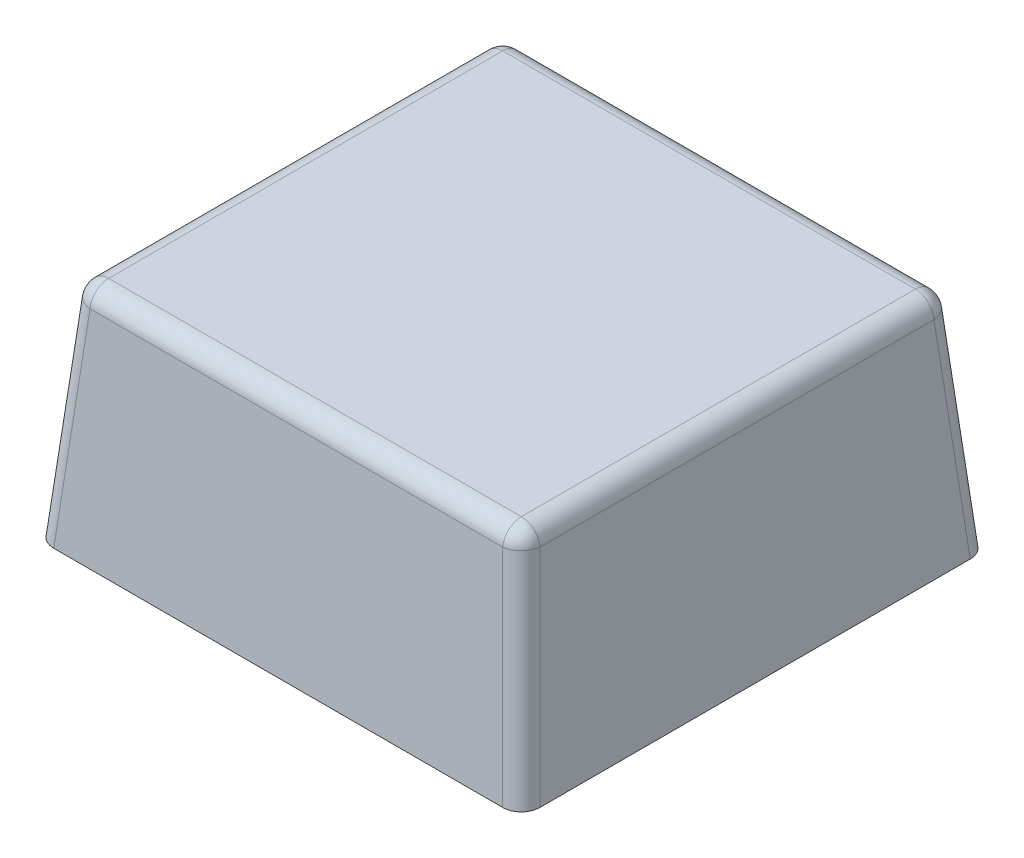
ISO-10303-21;
HEADER;
FILE_DESCRIPTION(('STEP AP214'),'2;1');
FILE_NAME('part.step','',(''),(''),'','','');
FILE_SCHEMA(('AUTOMOTIVE_DESIGN { 1 0 10303 214 1 1 1 1 }'));
ENDSEC;
DATA;
#1=APPLICATION_CONTEXT('core data for automotive mechanical design processes');
#2=APPLICATION_PROTOCOL_DEFINITION('international standard','automotive_design',2000,#1);
#3=PRODUCT_CONTEXT('',#1,'mechanical');
#4=PRODUCT('Part','Part','',(#3));
#5=PRODUCT_RELATED_PRODUCT_CATEGORY('part','',(#4));
#6=PRODUCT_DEFINITION_FORMATION('','',#4);
#7=PRODUCT_DEFINITION_CONTEXT('part definition',#1,'design');
#8=PRODUCT_DEFINITION('design','',#6,#7);
#9=PRODUCT_DEFINITION_SHAPE('','',#8);
#10=(LENGTH_UNIT() NAMED_UNIT(*) SI_UNIT(.MILLI.,.METRE.));
#11=(NAMED_UNIT(*) PLANE_ANGLE_UNIT() SI_UNIT($,.RADIAN.));
#12=(NAMED_UNIT(*) SI_UNIT($,.STERADIAN.) SOLID_ANGLE_UNIT());
#13=UNCERTAINTY_MEASURE_WITH_UNIT(LENGTH_MEASURE(1.E-05),#10,'distance_accuracy_value','');
#14=(GEOMETRIC_REPRESENTATION_CONTEXT(3) GLOBAL_UNCERTAINTY_ASSIGNED_CONTEXT((#13)) GLOBAL_UNIT_ASSIGNED_CONTEXT((#10,
#11,#12)) REPRESENTATION_CONTEXT('',''));
#15=CARTESIAN_POINT('',(0.,0.,0.));
#16=DIRECTION('',(0.,0.,1.));
#17=DIRECTION('',(1.,0.,0.));
#18=AXIS2_PLACEMENT_3D('',#15,#16,#17);
#19=CARTESIAN_POINT('',(0.,0.85,-0.526690243184));
#20=DIRECTION('',(-1.,0.,0.));
#21=DIRECTION('',(0.,0.,1.));
#22=AXIS2_PLACEMENT_3D('',#19,#20,#21);
#23=CYLINDRICAL_SURFACE('',#22,0.05);
#24=CARTESIAN_POINT('',(0.551690243184,0.85,-0.526690243184));
#25=DIRECTION('',(-1.,0.,0.));
#26=DIRECTION('',(0.,0.,-1.));
#27=AXIS2_PLACEMENT_3D('',#24,#25,#26);
#28=CIRCLE('',#27,0.05);
#29=CARTESIAN_POINT('',(0.551690243184,0.9,-0.526690243184));
#30=VERTEX_POINT('',#29);
#31=CARTESIAN_POINT('',(0.551690243184,0.854357787137,-0.576499978088));
#32=VERTEX_POINT('',#31);
#33=EDGE_CURVE('E20',#30,#32,#28,.T.);
#34=ORIENTED_EDGE('',*,*,#33,.T.);
#35=DIRECTION('',(1.,0.,0.));
#36=VECTOR('',#35,1.);
#37=CARTESIAN_POINT('',(0.597506801884,0.854357787137,-0.576499978088));
#38=LINE('',#37,#36);
#39=CARTESIAN_POINT('',(-0.551690243184,0.854357787137,-0.576499978088));
#40=VERTEX_POINT('',#39);
#41=EDGE_CURVE('E133',#40,#32,#38,.T.);
#42=ORIENTED_EDGE('',*,*,#41,.F.);
#43=CARTESIAN_POINT('',(-0.551690243184,0.85,-0.526690243184));
#44=DIRECTION('',(1.,0.,0.));
#45=DIRECTION('',(0.,0.,1.));
#46=AXIS2_PLACEMENT_3D('',#43,#44,#45);
#47=CIRCLE('',#46,0.05);
#48=CARTESIAN_POINT('',(-0.551690243184,0.9,-0.526690243184));
#49=VERTEX_POINT('',#48);
#50=EDGE_CURVE('E11',#40,#49,#47,.T.);
#51=ORIENTED_EDGE('',*,*,#50,.T.);
#52=DIRECTION('',(-1.,0.,0.));
#53=VECTOR('',#52,1.);
#54=CARTESIAN_POINT('',(-0.597506801884,0.9,-0.526690243184));
#55=LINE('',#54,#53);
#56=EDGE_CURVE('E114',#30,#49,#55,.T.);
#57=ORIENTED_EDGE('',*,*,#56,.F.);
#58=EDGE_LOOP('',(#34,#42,#51,#57));
#59=FACE_BOUND('',#58,.T.);
#60=ADVANCED_FACE('F17',(#59),#23,.T.);
#61=CARTESIAN_POINT('',(-0.551690243184,0.85,-0.526690243184));
#62=DIRECTION('',(0.,1.,0.));
#63=DIRECTION('',(1.,0.,0.));
#64=AXIS2_PLACEMENT_3D('',#61,#62,#63);
#65=SPHERICAL_SURFACE('',#64,0.05);
#66=CARTESIAN_POINT('',(-0.551690243184,0.85,-0.526690243184));
#67=DIRECTION('',(0.0868265938642471,0.992432509138969,0.0868265938642274));
#68=DIRECTION('',(0.,-0.0871557427476379,0.996194698091747));
#69=AXIS2_PLACEMENT_3D('',#66,#67,#68);
#70=CIRCLE('',#69,0.05);
#71=CARTESIAN_POINT('',(-0.601499978088,0.854357787137,-0.526690243184));
#72=VERTEX_POINT('',#71);
#73=EDGE_CURVE('E100',#40,#72,#70,.T.);
#74=ORIENTED_EDGE('',*,*,#73,.T.);
#75=CARTESIAN_POINT('',(-0.551690243184,0.85,-0.526690243184));
#76=DIRECTION('',(0.,0.,-1.));
#77=DIRECTION('',(0.,1.,0.));
#78=AXIS2_PLACEMENT_3D('',#75,#76,#77);
#79=CIRCLE('',#78,0.05);
#80=EDGE_CURVE('E111',#72,#49,#79,.T.);
#81=ORIENTED_EDGE('',*,*,#80,.T.);
#82=ORIENTED_EDGE('',*,*,#50,.F.);
#83=EDGE_LOOP('',(#74,#81,#82));
#84=FACE_BOUND('',#83,.T.);
#85=ADVANCED_FACE('F329',(#84),#65,.T.);
#86=CARTESIAN_POINT('',(0.551690243184,0.85,-0.526690243184));
#87=DIRECTION('',(0.,1.,0.));
#88=DIRECTION('',(1.,0.,0.));
#89=AXIS2_PLACEMENT_3D('',#86,#87,#88);
#90=SPHERICAL_SURFACE('',#89,0.05);
#91=CARTESIAN_POINT('',(0.551690243184,0.85,-0.526690243184));
#92=DIRECTION('',(0.,0.,-1.));
#93=DIRECTION('',(-1.,0.,0.));
#94=AXIS2_PLACEMENT_3D('',#91,#92,#93);
#95=CIRCLE('',#94,0.05);
#96=CARTESIAN_POINT('',(0.601499978088,0.854357787137,-0.526690243184));
#97=VERTEX_POINT('',#96);
#98=EDGE_CURVE('E92',#30,#97,#95,.T.);
#99=ORIENTED_EDGE('',*,*,#98,.T.);
#100=CARTESIAN_POINT('',(0.551690243184,0.85,-0.526690243184));
#101=DIRECTION('',(-0.0868265938642471,0.992432509138969,0.0868265938642274));
#102=DIRECTION('',(0.,-0.0871557427476379,0.996194698091747));
#103=AXIS2_PLACEMENT_3D('',#100,#101,#102);
#104=CIRCLE('',#103,0.05);
#105=EDGE_CURVE('E94',#97,#32,#104,.T.);
#106=ORIENTED_EDGE('',*,*,#105,.T.);
#107=ORIENTED_EDGE('',*,*,#33,.F.);
#108=EDGE_LOOP('',(#99,#106,#107));
#109=FACE_BOUND('',#108,.T.);
#110=ADVANCED_FACE('F91',(#109),#90,.T.);
#111=CARTESIAN_POINT('',(-0.591142201832,0.399062049208,-0.566142201832));
#112=DIRECTION('',(-0.0868265938642274,-0.992432509138969,-0.0868265938642471));
#113=DIRECTION('',(0.996194698091747,-0.0871557427476379,0.));
#114=AXIS2_PLACEMENT_3D('',#111,#112,#113);
#115=CYLINDRICAL_SURFACE('',#114,0.05);
#116=CARTESIAN_POINT('',(-0.65,0.3,-0.575190265095));
#117=CARTESIAN_POINT('',(-0.65,0.3,-0.604413846781));
#118=CARTESIAN_POINT('',(-0.629413846781,0.3,-0.625));
#119=CARTESIAN_POINT('',(-0.600190265095,0.3,-0.625));
#120=(BOUNDED_CURVE() B_SPLINE_CURVE(3,(#116,#117,#118,#119),.UNSPECIFIED.,.F.,
.F.) B_SPLINE_CURVE_WITH_KNOTS((4,4),(5.501585242055,7.064785372304),
.UNSPECIFIED.) CURVE() GEOMETRIC_REPRESENTATION_ITEM() RATIONAL_B_SPLINE_CURVE((1.,
0.806524890385,0.806524890385,1.)) REPRESENTATION_ITEM(''));
#121=CARTESIAN_POINT('',(-0.65,0.3,-0.575190265095));
#122=VERTEX_POINT('',#121);
#123=CARTESIAN_POINT('',(-0.600190265095,0.3,-0.625));
#124=VERTEX_POINT('',#123);
#125=EDGE_CURVE('E141',#122,#124,#120,.T.);
#126=ORIENTED_EDGE('',*,*,#125,.F.);
#127=DIRECTION('',(-0.0868265938642471,-0.992432509138967,-0.0868265938642471));
#128=VECTOR('',#127,1.);
#129=CARTESIAN_POINT('',(-0.640951936736,0.403419836345,-0.566142201832));
#130=LINE('',#129,#128);
#131=EDGE_CURVE('E234',#72,#122,#130,.T.);
#132=ORIENTED_EDGE('',*,*,#131,.F.);
#133=ORIENTED_EDGE('',*,*,#73,.F.);
#134=DIRECTION('',(0.0868265938642471,0.992432509138967,0.0868265938642471));
#135=VECTOR('',#134,1.);
#136=CARTESIAN_POINT('',(-0.590765258961,0.407728313066,-0.615574993866));
#137=LINE('',#136,#135);
#138=EDGE_CURVE('E199',#124,#40,#137,.T.);
#139=ORIENTED_EDGE('',*,*,#138,.F.);
#140=EDGE_LOOP('',(#126,#132,#133,#139));
#141=FACE_BOUND('',#140,.T.);
#142=ADVANCED_FACE('F229',(#141),#115,.T.);
#143=CARTESIAN_POINT('',(-0.551690243184,0.85,0.));
#144=DIRECTION('',(0.,0.,1.));
#145=DIRECTION('',(1.,0.,0.));
#146=AXIS2_PLACEMENT_3D('',#143,#144,#145);
#147=CYLINDRICAL_SURFACE('',#146,0.05);
#148=CARTESIAN_POINT('',(-0.551690243184,0.85,0.526690243184));
#149=DIRECTION('',(0.,0.,-1.));
#150=DIRECTION('',(1.,0.,0.));
#151=AXIS2_PLACEMENT_3D('',#148,#149,#150);
#152=CIRCLE('',#151,0.05);
#153=CARTESIAN_POINT('',(-0.601499978088,0.854357787137,0.526690243184));
#154=VERTEX_POINT('',#153);
#155=CARTESIAN_POINT('',(-0.551690243184,0.9,0.526690243184));
#156=VERTEX_POINT('',#155);
#157=EDGE_CURVE('E39',#154,#156,#152,.T.);
#158=ORIENTED_EDGE('',*,*,#157,.T.);
#159=DIRECTION('',(0.,0.,1.));
#160=VECTOR('',#159,1.);
#161=CARTESIAN_POINT('',(-0.551690243184,0.9,0.572506801884));
#162=LINE('',#161,#160);
#163=EDGE_CURVE('E119',#49,#156,#162,.T.);
#164=ORIENTED_EDGE('',*,*,#163,.F.);
#165=ORIENTED_EDGE('',*,*,#80,.F.);
#166=DIRECTION('',(0.,0.,-1.));
#167=VECTOR('',#166,1.);
#168=CARTESIAN_POINT('',(-0.601499978088,0.854357787137,-0.572506801884));
#169=LINE('',#168,#167);
#170=EDGE_CURVE('E243',#154,#72,#169,.T.);
#171=ORIENTED_EDGE('',*,*,#170,.F.);
#172=EDGE_LOOP('',(#158,#164,#165,#171));
#173=FACE_BOUND('',#172,.T.);
#174=ADVANCED_FACE('F349',(#173),#147,.T.);
#175=CARTESIAN_POINT('',(0.551690243184,0.85,0.));
#176=DIRECTION('',(0.,0.,-1.));
#177=DIRECTION('',(-1.,0.,0.));
#178=AXIS2_PLACEMENT_3D('',#175,#176,#177);
#179=CYLINDRICAL_SURFACE('',#178,0.05);
#180=CARTESIAN_POINT('',(0.551690243184,0.85,0.526690243184));
#181=DIRECTION('',(0.,0.,-1.));
#182=DIRECTION('',(0.,-1.,0.));
#183=AXIS2_PLACEMENT_3D('',#180,#181,#182);
#184=CIRCLE('',#183,0.05);
#185=CARTESIAN_POINT('',(0.551690243184,0.9,0.526690243184));
#186=VERTEX_POINT('',#185);
#187=CARTESIAN_POINT('',(0.601499978088,0.854357787137,0.526690243184));
#188=VERTEX_POINT('',#187);
#189=EDGE_CURVE('E144',#186,#188,#184,.T.);
#190=ORIENTED_EDGE('',*,*,#189,.T.);
#191=DIRECTION('',(0.,0.,1.));
#192=VECTOR('',#191,1.);
#193=CARTESIAN_POINT('',(0.601499978088,0.854357787137,0.572506801884));
#194=LINE('',#193,#192);
#195=EDGE_CURVE('E108',#97,#188,#194,.T.);
#196=ORIENTED_EDGE('',*,*,#195,.F.);
#197=ORIENTED_EDGE('',*,*,#98,.F.);
#198=DIRECTION('',(0.,0.,-1.));
#199=VECTOR('',#198,1.);
#200=CARTESIAN_POINT('',(0.551690243184,0.9,-0.572506801884));
#201=LINE('',#200,#199);
#202=EDGE_CURVE('E106',#186,#30,#201,.T.);
#203=ORIENTED_EDGE('',*,*,#202,.F.);
#204=EDGE_LOOP('',(#190,#196,#197,#203));
#205=FACE_BOUND('',#204,.T.);
#206=ADVANCED_FACE('F104',(#205),#179,.T.);
#207=CARTESIAN_POINT('',(0.600565773584,0.291350131197,-0.575565773584));
#208=DIRECTION('',(0.0868265938642471,-0.992432509138969,-0.0868265938642274));
#209=DIRECTION('',(0.,0.0871557427476379,-0.996194698091747));
#210=AXIS2_PLACEMENT_3D('',#207,#208,#209);
#211=CYLINDRICAL_SURFACE('',#210,0.05);
#212=CARTESIAN_POINT('',(0.600190265095,0.3,-0.625));
#213=CARTESIAN_POINT('',(0.629413846781,0.3,-0.625));
#214=CARTESIAN_POINT('',(0.65,0.3,-0.604413846781));
#215=CARTESIAN_POINT('',(0.65,0.3,-0.575190265095));
#216=(BOUNDED_CURVE() B_SPLINE_CURVE(3,(#212,#213,#214,#215),.UNSPECIFIED.,.F.,
.F.) B_SPLINE_CURVE_WITH_KNOTS((4,4),(5.501585242055,7.064785372304),
.UNSPECIFIED.) CURVE() GEOMETRIC_REPRESENTATION_ITEM() RATIONAL_B_SPLINE_CURVE((1.,
0.806524890385,0.806524890385,1.)) REPRESENTATION_ITEM(''));
#217=CARTESIAN_POINT('',(0.600190265095,0.3,-0.625));
#218=VERTEX_POINT('',#217);
#219=CARTESIAN_POINT('',(0.65,0.3,-0.575190265095));
#220=VERTEX_POINT('',#219);
#221=EDGE_CURVE('E149',#218,#220,#216,.T.);
#222=ORIENTED_EDGE('',*,*,#221,.F.);
#223=DIRECTION('',(0.0868265938642471,-0.992432509138967,-0.0868265938642471));
#224=VECTOR('',#223,1.);
#225=CARTESIAN_POINT('',(0.600565773584,0.295707918334,-0.625375508489));
#226=LINE('',#225,#224);
#227=EDGE_CURVE('E126',#32,#218,#226,.T.);
#228=ORIENTED_EDGE('',*,*,#227,.F.);
#229=ORIENTED_EDGE('',*,*,#105,.F.);
#230=DIRECTION('',(-0.0868265938642471,0.992432509138967,0.0868265938642471));
#231=VECTOR('',#230,1.);
#232=CARTESIAN_POINT('',(0.640951936736,0.403419836345,-0.566142201832));
#233=LINE('',#232,#231);
#234=EDGE_CURVE('E204',#220,#97,#233,.T.);
#235=ORIENTED_EDGE('',*,*,#234,.F.);
#236=EDGE_LOOP('',(#222,#228,#229,#235));
#237=FACE_BOUND('',#236,.T.);
#238=ADVANCED_FACE('F360',(#237),#211,.T.);
#239=CARTESIAN_POINT('',(-0.551690243184,0.85,0.526690243184));
#240=DIRECTION('',(0.,1.,0.));
#241=DIRECTION('',(1.,0.,0.));
#242=AXIS2_PLACEMENT_3D('',#239,#240,#241);
#243=SPHERICAL_SURFACE('',#242,0.05);
#244=CARTESIAN_POINT('',(-0.551690243184,0.85,0.526690243184));
#245=DIRECTION('',(0.0868265938642471,0.992432509138969,-0.0868265938642274));
#246=DIRECTION('',(0.,0.0871557427476379,0.996194698091747));
#247=AXIS2_PLACEMENT_3D('',#244,#245,#246);
#248=CIRCLE('',#247,0.05);
#249=CARTESIAN_POINT('',(-0.551690243184,0.854357787137,0.576499978088));
#250=VERTEX_POINT('',#249);
#251=EDGE_CURVE('E178',#154,#250,#248,.T.);
#252=ORIENTED_EDGE('',*,*,#251,.T.);
#253=CARTESIAN_POINT('',(-0.551690243184,0.85,0.526690243184));
#254=DIRECTION('',(-1.,0.,0.));
#255=DIRECTION('',(0.,0.,1.));
#256=AXIS2_PLACEMENT_3D('',#253,#254,#255);
#257=CIRCLE('',#256,0.05);
#258=EDGE_CURVE('E174',#250,#156,#257,.T.);
#259=ORIENTED_EDGE('',*,*,#258,.T.);
#260=ORIENTED_EDGE('',*,*,#157,.F.);
#261=EDGE_LOOP('',(#252,#259,#260));
#262=FACE_BOUND('',#261,.T.);
#263=ADVANCED_FACE('F354',(#262),#243,.T.);
#264=CARTESIAN_POINT('',(0.551690243184,0.85,0.526690243184));
#265=DIRECTION('',(0.,1.,0.));
#266=DIRECTION('',(1.,0.,0.));
#267=AXIS2_PLACEMENT_3D('',#264,#265,#266);
#268=SPHERICAL_SURFACE('',#267,0.05);
#269=CARTESIAN_POINT('',(0.551690243184,0.85,0.526690243184));
#270=DIRECTION('',(1.,0.,0.));
#271=DIRECTION('',(0.,0.,-1.));
#272=AXIS2_PLACEMENT_3D('',#269,#270,#271);
#273=CIRCLE('',#272,0.05);
#274=CARTESIAN_POINT('',(0.551690243184,0.854357787137,0.576499978088));
#275=VERTEX_POINT('',#274);
#276=EDGE_CURVE('E177',#186,#275,#273,.T.);
#277=ORIENTED_EDGE('',*,*,#276,.T.);
#278=CARTESIAN_POINT('',(0.551690243184,0.85,0.526690243184));
#279=DIRECTION('',(-0.0868265938642471,0.992432509138969,-0.0868265938642274));
#280=DIRECTION('',(0.,0.0871557427476379,0.996194698091747));
#281=AXIS2_PLACEMENT_3D('',#278,#279,#280);
#282=CIRCLE('',#281,0.05);
#283=EDGE_CURVE('E167',#275,#188,#282,.T.);
#284=ORIENTED_EDGE('',*,*,#283,.T.);
#285=ORIENTED_EDGE('',*,*,#189,.F.);
#286=EDGE_LOOP('',(#277,#284,#285));
#287=FACE_BOUND('',#286,.T.);
#288=ADVANCED_FACE('F359',(#287),#268,.T.);
#289=CARTESIAN_POINT('',(-0.590765258961,0.403370525928,0.565765258961));
#290=DIRECTION('',(-0.0868265938642471,-0.992432509138969,0.0868265938642274));
#291=DIRECTION('',(0.,-0.0871557427476379,-0.996194698091747));
#292=AXIS2_PLACEMENT_3D('',#289,#290,#291);
#293=CYLINDRICAL_SURFACE('',#292,0.05);
#294=CARTESIAN_POINT('',(-0.600190265095,0.3,0.625));
#295=CARTESIAN_POINT('',(-0.629413846781,0.3,0.625));
#296=CARTESIAN_POINT('',(-0.65,0.3,0.604413846781));
#297=CARTESIAN_POINT('',(-0.65,0.3,0.575190265095));
#298=(BOUNDED_CURVE() B_SPLINE_CURVE(3,(#294,#295,#296,#297),.UNSPECIFIED.,.F.,
.F.) B_SPLINE_CURVE_WITH_KNOTS((4,4),(5.501585242055,7.064785372304),
.UNSPECIFIED.) CURVE() GEOMETRIC_REPRESENTATION_ITEM() RATIONAL_B_SPLINE_CURVE((1.,
0.806524890385,0.806524890385,1.)) REPRESENTATION_ITEM(''));
#299=CARTESIAN_POINT('',(-0.600190265095,0.3,0.625));
#300=VERTEX_POINT('',#299);
#301=CARTESIAN_POINT('',(-0.65,0.3,0.575190265095));
#302=VERTEX_POINT('',#301);
#303=EDGE_CURVE('E158',#300,#302,#298,.T.);
#304=ORIENTED_EDGE('',*,*,#303,.F.);
#305=DIRECTION('',(-0.0868265938642471,-0.992432509138967,0.0868265938642471));
#306=VECTOR('',#305,1.);
#307=CARTESIAN_POINT('',(-0.590765258961,0.407728313066,0.615574993866));
#308=LINE('',#307,#306);
#309=EDGE_CURVE('E275',#250,#300,#308,.T.);
#310=ORIENTED_EDGE('',*,*,#309,.F.);
#311=ORIENTED_EDGE('',*,*,#251,.F.);
#312=DIRECTION('',(0.0868265938642471,0.992432509138967,-0.0868265938642471));
#313=VECTOR('',#312,1.);
#314=CARTESIAN_POINT('',(-0.650375508489,0.295707918334,0.575565773584));
#315=LINE('',#314,#313);
#316=EDGE_CURVE('E248',#302,#154,#315,.T.);
#317=ORIENTED_EDGE('',*,*,#316,.F.);
#318=EDGE_LOOP('',(#304,#310,#311,#317));
#319=FACE_BOUND('',#318,.T.);
#320=ADVANCED_FACE('F309',(#319),#293,.T.);
#321=CARTESIAN_POINT('',(0.,0.85,0.526690243184));
#322=DIRECTION('',(1.,0.,0.));
#323=DIRECTION('',(0.,0.,-1.));
#324=AXIS2_PLACEMENT_3D('',#321,#322,#323);
#325=CYLINDRICAL_SURFACE('',#324,0.05);
#326=ORIENTED_EDGE('',*,*,#258,.F.);
#327=DIRECTION('',(-1.,0.,0.));
#328=VECTOR('',#327,1.);
#329=CARTESIAN_POINT('',(-0.597506801884,0.854357787137,0.576499978088));
#330=LINE('',#329,#328);
#331=EDGE_CURVE('E267',#275,#250,#330,.T.);
#332=ORIENTED_EDGE('',*,*,#331,.F.);
#333=ORIENTED_EDGE('',*,*,#276,.F.);
#334=DIRECTION('',(1.,0.,0.));
#335=VECTOR('',#334,1.);
#336=CARTESIAN_POINT('',(0.597506801884,0.9,0.526690243184));
#337=LINE('',#336,#335);
#338=EDGE_CURVE('E124',#156,#186,#337,.T.);
#339=ORIENTED_EDGE('',*,*,#338,.F.);
#340=EDGE_LOOP('',(#326,#332,#333,#339));
#341=FACE_BOUND('',#340,.T.);
#342=ADVANCED_FACE('F301',(#341),#325,.T.);
#343=CARTESIAN_POINT('',(0.600565773584,0.291350131197,0.575565773584));
#344=DIRECTION('',(0.0868265938642274,-0.992432509138969,0.0868265938642471));
#345=DIRECTION('',(0.996194698091747,0.0871557427476379,0.));
#346=AXIS2_PLACEMENT_3D('',#343,#344,#345);
#347=CYLINDRICAL_SURFACE('',#346,0.05);
#348=CARTESIAN_POINT('',(0.65,0.3,0.575190265095));
#349=CARTESIAN_POINT('',(0.65,0.3,0.604413846781));
#350=CARTESIAN_POINT('',(0.629413846781,0.3,0.625));
#351=CARTESIAN_POINT('',(0.600190265095,0.3,0.625));
#352=(BOUNDED_CURVE() B_SPLINE_CURVE(3,(#348,#349,#350,#351),.UNSPECIFIED.,.F.,
.F.) B_SPLINE_CURVE_WITH_KNOTS((4,4),(5.501585242055,7.064785372304),
.UNSPECIFIED.) CURVE() GEOMETRIC_REPRESENTATION_ITEM() RATIONAL_B_SPLINE_CURVE((1.,
0.806524890385,0.806524890385,1.)) REPRESENTATION_ITEM(''));
#353=CARTESIAN_POINT('',(0.65,0.3,0.575190265095));
#354=VERTEX_POINT('',#353);
#355=CARTESIAN_POINT('',(0.600190265095,0.3,0.625));
#356=VERTEX_POINT('',#355);
#357=EDGE_CURVE('E157',#354,#356,#352,.T.);
#358=ORIENTED_EDGE('',*,*,#357,.F.);
#359=DIRECTION('',(0.0868265938642471,-0.992432509138967,0.0868265938642471));
#360=VECTOR('',#359,1.);
#361=CARTESIAN_POINT('',(0.650375508489,0.295707918334,0.575565773584));
#362=LINE('',#361,#360);
#363=EDGE_CURVE('E208',#188,#354,#362,.T.);
#364=ORIENTED_EDGE('',*,*,#363,.F.);
#365=ORIENTED_EDGE('',*,*,#283,.F.);
#366=DIRECTION('',(-0.0868265938642471,0.992432509138967,-0.0868265938642471));
#367=VECTOR('',#366,1.);
#368=CARTESIAN_POINT('',(0.600565773584,0.295707918334,0.625375508489));
#369=LINE('',#368,#367);
#370=EDGE_CURVE('E271',#356,#275,#369,.T.);
#371=ORIENTED_EDGE('',*,*,#370,.F.);
#372=EDGE_LOOP('',(#358,#364,#365,#371));
#373=FACE_BOUND('',#372,.T.);
#374=ADVANCED_FACE('F378',(#373),#347,.T.);
#375=CARTESIAN_POINT('',(0.,0.3,0.));
#376=DIRECTION('',(0.,1.,0.));
#377=DIRECTION('',(1.,0.,0.));
#378=AXIS2_PLACEMENT_3D('',#375,#376,#377);
#379=PLANE('',#378);
#380=DIRECTION('',(0.,0.,1.));
#381=VECTOR('',#380,1.);
#382=CARTESIAN_POINT('',(-0.65,0.3,0.625));
#383=LINE('',#382,#381);
#384=EDGE_CURVE('E242',#122,#302,#383,.T.);
#385=ORIENTED_EDGE('',*,*,#384,.F.);
#386=ORIENTED_EDGE('',*,*,#125,.T.);
#387=DIRECTION('',(-1.,0.,0.));
#388=VECTOR('',#387,1.);
#389=CARTESIAN_POINT('',(0.65,0.3,-0.625));
#390=LINE('',#389,#388);
#391=EDGE_CURVE('E212',#218,#124,#390,.T.);
#392=ORIENTED_EDGE('',*,*,#391,.F.);
#393=ORIENTED_EDGE('',*,*,#221,.T.);
#394=DIRECTION('',(0.,0.,-1.));
#395=VECTOR('',#394,1.);
#396=CARTESIAN_POINT('',(0.65,0.3,0.625));
#397=LINE('',#396,#395);
#398=EDGE_CURVE('E207',#354,#220,#397,.T.);
#399=ORIENTED_EDGE('',*,*,#398,.F.);
#400=ORIENTED_EDGE('',*,*,#357,.T.);
#401=DIRECTION('',(1.,0.,0.));
#402=VECTOR('',#401,1.);
#403=CARTESIAN_POINT('',(0.65,0.3,0.625));
#404=LINE('',#403,#402);
#405=EDGE_CURVE('E279',#300,#356,#404,.T.);
#406=ORIENTED_EDGE('',*,*,#405,.F.);
#407=ORIENTED_EDGE('',*,*,#303,.T.);
#408=EDGE_LOOP('',(#385,#386,#392,#393,#399,#400,#406,#407));
#409=FACE_BOUND('',#408,.T.);
#410=ADVANCED_FACE('F394',(#409),#379,.F.);
#411=CARTESIAN_POINT('',(0.,0.9,0.));
#412=DIRECTION('',(0.,1.,0.));
#413=DIRECTION('',(1.,0.,0.));
#414=AXIS2_PLACEMENT_3D('',#411,#412,#413);
#415=PLANE('',#414);
#416=ORIENTED_EDGE('',*,*,#202,.T.);
#417=ORIENTED_EDGE('',*,*,#56,.T.);
#418=ORIENTED_EDGE('',*,*,#163,.T.);
#419=ORIENTED_EDGE('',*,*,#338,.T.);
#420=EDGE_LOOP('',(#416,#417,#418,#419));
#421=FACE_BOUND('',#420,.T.);
#422=ADVANCED_FACE('F122',(#421),#415,.T.);
#423=CARTESIAN_POINT('',(0.65,0.3,-0.625));
#424=DIRECTION('',(0.,0.0871557427476379,-0.996194698091747));
#425=DIRECTION('',(-1.,0.,0.));
#426=AXIS2_PLACEMENT_3D('',#423,#424,#425);
#427=PLANE('',#426);
#428=ORIENTED_EDGE('',*,*,#391,.T.);
#429=ORIENTED_EDGE('',*,*,#138,.T.);
#430=ORIENTED_EDGE('',*,*,#41,.T.);
#431=ORIENTED_EDGE('',*,*,#227,.T.);
#432=EDGE_LOOP('',(#428,#429,#430,#431));
#433=FACE_BOUND('',#432,.T.);
#434=ADVANCED_FACE('F225',(#433),#427,.T.);
#435=CARTESIAN_POINT('',(0.65,0.3,0.625));
#436=DIRECTION('',(0.996194698091747,0.0871557427476379,0.));
#437=DIRECTION('',(0.,0.,-1.));
#438=AXIS2_PLACEMENT_3D('',#435,#436,#437);
#439=PLANE('',#438);
#440=ORIENTED_EDGE('',*,*,#398,.T.);
#441=ORIENTED_EDGE('',*,*,#234,.T.);
#442=ORIENTED_EDGE('',*,*,#195,.T.);
#443=ORIENTED_EDGE('',*,*,#363,.T.);
#444=EDGE_LOOP('',(#440,#441,#442,#443));
#445=FACE_BOUND('',#444,.T.);
#446=ADVANCED_FACE('F423',(#445),#439,.T.);
#447=CARTESIAN_POINT('',(0.65,0.3,0.625));
#448=DIRECTION('',(0.,0.0871557427476379,0.996194698091747));
#449=DIRECTION('',(1.,0.,0.));
#450=AXIS2_PLACEMENT_3D('',#447,#448,#449);
#451=PLANE('',#450);
#452=ORIENTED_EDGE('',*,*,#331,.T.);
#453=ORIENTED_EDGE('',*,*,#309,.T.);
#454=ORIENTED_EDGE('',*,*,#405,.T.);
#455=ORIENTED_EDGE('',*,*,#370,.T.);
#456=EDGE_LOOP('',(#452,#453,#454,#455));
#457=FACE_BOUND('',#456,.T.);
#458=ADVANCED_FACE('F290',(#457),#451,.T.);
#459=CARTESIAN_POINT('',(-0.65,0.3,0.625));
#460=DIRECTION('',(-0.996194698091747,0.0871557427476379,0.));
#461=DIRECTION('',(0.,0.,1.));
#462=AXIS2_PLACEMENT_3D('',#459,#460,#461);
#463=PLANE('',#462);
#464=ORIENTED_EDGE('',*,*,#170,.T.);
#465=ORIENTED_EDGE('',*,*,#131,.T.);
#466=ORIENTED_EDGE('',*,*,#384,.T.);
#467=ORIENTED_EDGE('',*,*,#316,.T.);
#468=EDGE_LOOP('',(#464,#465,#466,#467));
#469=FACE_BOUND('',#468,.T.);
#470=ADVANCED_FACE('F246',(#469),#463,.T.);
#471=CLOSED_SHELL('',(#60,#85,#110,#142,#174,#206,#238,#263,#288,#320,#342,#374,#410,#422,#434,
#446,#458,#470));
#472=MANIFOLD_SOLID_BREP('B1',#471);
#473=ADVANCED_BREP_SHAPE_REPRESENTATION('',(#18,#472),#14);
#474=SHAPE_DEFINITION_REPRESENTATION(#9,#473);
ENDSEC;
END-ISO-10303-21;
